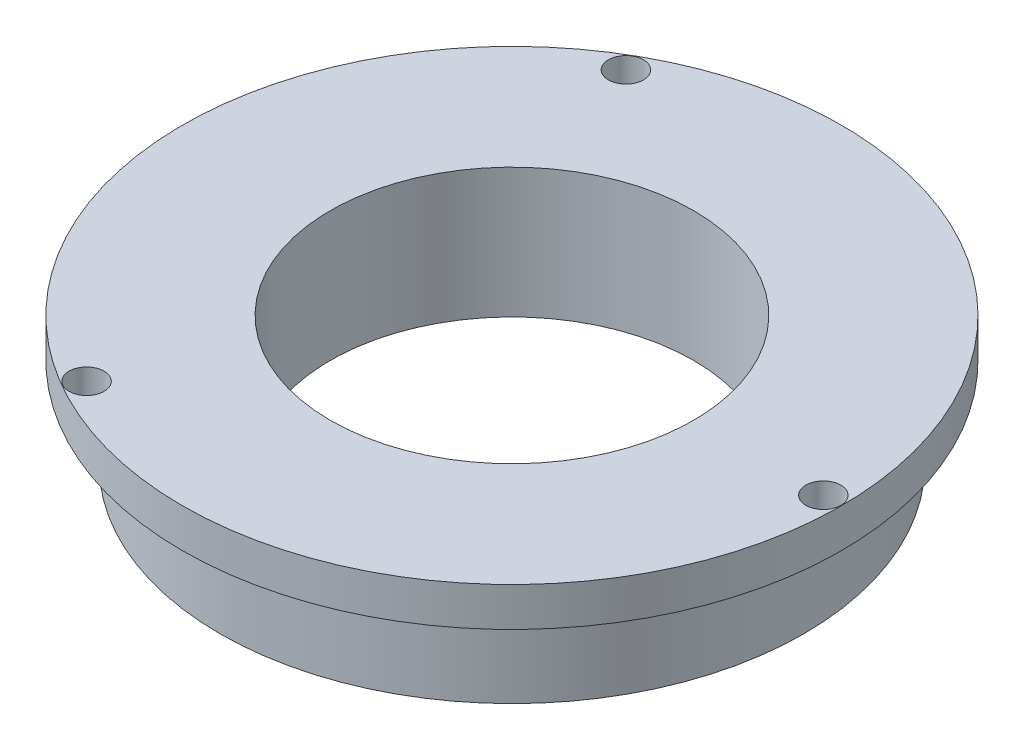
ISO-10303-21;
HEADER;
FILE_DESCRIPTION(('STEP AP214'),'2;1');
FILE_NAME('part.step','',(''),(''),'','','');
FILE_SCHEMA(('AUTOMOTIVE_DESIGN { 1 0 10303 214 1 1 1 1 }'));
ENDSEC;
DATA;
#1=APPLICATION_CONTEXT('core data for automotive mechanical design processes');
#2=APPLICATION_PROTOCOL_DEFINITION('international standard','automotive_design',2000,#1);
#3=PRODUCT_CONTEXT('',#1,'mechanical');
#4=PRODUCT('Part','Part','',(#3));
#5=PRODUCT_RELATED_PRODUCT_CATEGORY('part','',(#4));
#6=PRODUCT_DEFINITION_FORMATION('','',#4);
#7=PRODUCT_DEFINITION_CONTEXT('part definition',#1,'design');
#8=PRODUCT_DEFINITION('design','',#6,#7);
#9=PRODUCT_DEFINITION_SHAPE('','',#8);
#10=(LENGTH_UNIT() NAMED_UNIT(*) SI_UNIT(.MILLI.,.METRE.));
#11=(NAMED_UNIT(*) PLANE_ANGLE_UNIT() SI_UNIT($,.RADIAN.));
#12=(NAMED_UNIT(*) SI_UNIT($,.STERADIAN.) SOLID_ANGLE_UNIT());
#13=UNCERTAINTY_MEASURE_WITH_UNIT(LENGTH_MEASURE(1.E-05),#10,'distance_accuracy_value','');
#14=(GEOMETRIC_REPRESENTATION_CONTEXT(3) GLOBAL_UNCERTAINTY_ASSIGNED_CONTEXT((#13)) GLOBAL_UNIT_ASSIGNED_CONTEXT((#10,
#11,#12)) REPRESENTATION_CONTEXT('',''));
#15=CARTESIAN_POINT('',(0.,0.,0.));
#16=DIRECTION('',(0.,0.,1.));
#17=DIRECTION('',(1.,0.,0.));
#18=AXIS2_PLACEMENT_3D('',#15,#16,#17);
#19=CARTESIAN_POINT('',(0.,10.,0.));
#20=DIRECTION('',(0.,1.,0.));
#21=DIRECTION('',(0.,0.,1.));
#22=AXIS2_PLACEMENT_3D('',#19,#20,#21);
#23=PLANE('',#22);
#24=CARTESIAN_POINT('',(-12.0000000000001,10.,20.7846096908265));
#25=DIRECTION('',(0.,1.,0.));
#26=DIRECTION('',(0.,0.,1.));
#27=AXIS2_PLACEMENT_3D('',#24,#25,#26);
#28=CIRCLE('',#27,1.35);
#29=CARTESIAN_POINT('',(-12.0000000000001,10.,22.1346096908265));
#30=VERTEX_POINT('',#29);
#31=EDGE_CURVE('E51',#30,#30,#28,.F.);
#32=ORIENTED_EDGE('',*,*,#31,.T.);
#33=EDGE_LOOP('',(#32));
#34=FACE_BOUND('',#33,.T.);
#35=CARTESIAN_POINT('',(0.,10.,0.));
#36=DIRECTION('',(0.,1.,0.));
#37=DIRECTION('',(0.,0.,1.));
#38=AXIS2_PLACEMENT_3D('',#35,#36,#37);
#39=CIRCLE('',#38,14.);
#40=CARTESIAN_POINT('',(0.,10.,14.));
#41=VERTEX_POINT('',#40);
#42=EDGE_CURVE('E39',#41,#41,#39,.F.);
#43=ORIENTED_EDGE('',*,*,#42,.T.);
#44=EDGE_LOOP('',(#43));
#45=FACE_BOUND('',#44,.T.);
#46=CARTESIAN_POINT('',(0.,10.,0.));
#47=DIRECTION('',(0.,1.,0.));
#48=DIRECTION('',(0.,0.,1.));
#49=AXIS2_PLACEMENT_3D('',#46,#47,#48);
#50=CIRCLE('',#49,25.4);
#51=CARTESIAN_POINT('',(0.,10.,25.4));
#52=VERTEX_POINT('',#51);
#53=EDGE_CURVE('E10',#52,#52,#50,.T.);
#54=ORIENTED_EDGE('',*,*,#53,.T.);
#55=EDGE_LOOP('',(#54));
#56=FACE_BOUND('',#55,.T.);
#57=CARTESIAN_POINT('',(24.,10.,0.));
#58=DIRECTION('',(0.,1.,0.));
#59=DIRECTION('',(0.,0.,1.));
#60=AXIS2_PLACEMENT_3D('',#57,#58,#59);
#61=CIRCLE('',#60,1.35);
#62=CARTESIAN_POINT('',(24.,10.,1.35));
#63=VERTEX_POINT('',#62);
#64=EDGE_CURVE('E50',#63,#63,#61,.F.);
#65=ORIENTED_EDGE('',*,*,#64,.T.);
#66=EDGE_LOOP('',(#65));
#67=FACE_BOUND('',#66,.T.);
#68=CARTESIAN_POINT('',(-11.9999999999998,10.,-20.7846096908266));
#69=DIRECTION('',(0.,1.,0.));
#70=DIRECTION('',(0.,0.,1.));
#71=AXIS2_PLACEMENT_3D('',#68,#69,#70);
#72=CIRCLE('',#71,1.35);
#73=CARTESIAN_POINT('',(-11.9999999999998,10.,-19.4346096908266));
#74=VERTEX_POINT('',#73);
#75=EDGE_CURVE('E54',#74,#74,#72,.F.);
#76=ORIENTED_EDGE('',*,*,#75,.T.);
#77=EDGE_LOOP('',(#76));
#78=FACE_BOUND('',#77,.T.);
#79=ADVANCED_FACE('F31',(#34,#45,#56,#67,#78),#23,.T.);
#80=CARTESIAN_POINT('',(0.,7.,0.));
#81=DIRECTION('',(0.,1.,0.));
#82=DIRECTION('',(0.,0.,1.));
#83=AXIS2_PLACEMENT_3D('',#80,#81,#82);
#84=PLANE('',#83);
#85=CARTESIAN_POINT('',(-12.0000000000001,7.,20.7846096908265));
#86=DIRECTION('',(0.,1.,0.));
#87=DIRECTION('',(0.,0.,1.));
#88=AXIS2_PLACEMENT_3D('',#85,#86,#87);
#89=CIRCLE('',#88,1.35);
#90=CARTESIAN_POINT('',(-12.0000000000001,7.,22.1346096908265));
#91=VERTEX_POINT('',#90);
#92=EDGE_CURVE('E52',#91,#91,#89,.F.);
#93=ORIENTED_EDGE('',*,*,#92,.F.);
#94=EDGE_LOOP('',(#93));
#95=FACE_BOUND('',#94,.T.);
#96=CARTESIAN_POINT('',(0.,7.,0.));
#97=DIRECTION('',(0.,1.,0.));
#98=DIRECTION('',(0.,0.,1.));
#99=AXIS2_PLACEMENT_3D('',#96,#97,#98);
#100=CIRCLE('',#99,22.5);
#101=CARTESIAN_POINT('',(0.,7.,22.5));
#102=VERTEX_POINT('',#101);
#103=EDGE_CURVE('E68',#102,#102,#100,.T.);
#104=ORIENTED_EDGE('',*,*,#103,.T.);
#105=EDGE_LOOP('',(#104));
#106=FACE_BOUND('',#105,.T.);
#107=CARTESIAN_POINT('',(0.,7.,0.));
#108=DIRECTION('',(0.,1.,0.));
#109=DIRECTION('',(0.,0.,1.));
#110=AXIS2_PLACEMENT_3D('',#107,#108,#109);
#111=CIRCLE('',#110,25.4);
#112=CARTESIAN_POINT('',(0.,7.,25.4));
#113=VERTEX_POINT('',#112);
#114=EDGE_CURVE('E71',#113,#113,#111,.T.);
#115=ORIENTED_EDGE('',*,*,#114,.F.);
#116=EDGE_LOOP('',(#115));
#117=FACE_BOUND('',#116,.T.);
#118=CARTESIAN_POINT('',(24.,7.,0.));
#119=DIRECTION('',(0.,1.,0.));
#120=DIRECTION('',(0.,0.,1.));
#121=AXIS2_PLACEMENT_3D('',#118,#119,#120);
#122=CIRCLE('',#121,1.35);
#123=CARTESIAN_POINT('',(24.,7.,1.35));
#124=VERTEX_POINT('',#123);
#125=EDGE_CURVE('E48',#124,#124,#122,.F.);
#126=ORIENTED_EDGE('',*,*,#125,.F.);
#127=EDGE_LOOP('',(#126));
#128=FACE_BOUND('',#127,.T.);
#129=CARTESIAN_POINT('',(-11.9999999999998,7.,-20.7846096908266));
#130=DIRECTION('',(0.,1.,0.));
#131=DIRECTION('',(0.,0.,1.));
#132=AXIS2_PLACEMENT_3D('',#129,#130,#131);
#133=CIRCLE('',#132,1.35);
#134=CARTESIAN_POINT('',(-11.9999999999998,7.,-19.4346096908266));
#135=VERTEX_POINT('',#134);
#136=EDGE_CURVE('E35',#135,#135,#133,.F.);
#137=ORIENTED_EDGE('',*,*,#136,.F.);
#138=EDGE_LOOP('',(#137));
#139=FACE_BOUND('',#138,.T.);
#140=ADVANCED_FACE('F97',(#95,#106,#117,#128,#139),#84,.F.);
#141=CARTESIAN_POINT('',(0.,0.,0.));
#142=DIRECTION('',(0.,1.,0.));
#143=DIRECTION('',(0.,0.,1.));
#144=AXIS2_PLACEMENT_3D('',#141,#142,#143);
#145=PLANE('',#144);
#146=CARTESIAN_POINT('',(0.,0.,0.));
#147=DIRECTION('',(0.,1.,0.));
#148=DIRECTION('',(0.,0.,1.));
#149=AXIS2_PLACEMENT_3D('',#146,#147,#148);
#150=CIRCLE('',#149,22.5);
#151=CARTESIAN_POINT('',(0.,0.,22.5));
#152=VERTEX_POINT('',#151);
#153=EDGE_CURVE('E67',#152,#152,#150,.T.);
#154=ORIENTED_EDGE('',*,*,#153,.F.);
#155=EDGE_LOOP('',(#154));
#156=FACE_BOUND('',#155,.T.);
#157=CARTESIAN_POINT('',(0.,0.,0.));
#158=DIRECTION('',(0.,1.,0.));
#159=DIRECTION('',(0.,0.,1.));
#160=AXIS2_PLACEMENT_3D('',#157,#158,#159);
#161=CIRCLE('',#160,14.);
#162=CARTESIAN_POINT('',(0.,0.,14.));
#163=VERTEX_POINT('',#162);
#164=EDGE_CURVE('E44',#163,#163,#161,.T.);
#165=ORIENTED_EDGE('',*,*,#164,.T.);
#166=EDGE_LOOP('',(#165));
#167=FACE_BOUND('',#166,.T.);
#168=ADVANCED_FACE('F78',(#156,#167),#145,.F.);
#169=CARTESIAN_POINT('',(0.,10.,0.));
#170=DIRECTION('',(0.,-1.,0.));
#171=DIRECTION('',(0.,0.,-1.));
#172=AXIS2_PLACEMENT_3D('',#169,#170,#171);
#173=CYLINDRICAL_SURFACE('',#172,25.4);
#174=ORIENTED_EDGE('',*,*,#114,.T.);
#175=EDGE_LOOP('',(#174));
#176=FACE_BOUND('',#175,.T.);
#177=ORIENTED_EDGE('',*,*,#53,.F.);
#178=EDGE_LOOP('',(#177));
#179=FACE_BOUND('',#178,.T.);
#180=ADVANCED_FACE('F33',(#176,#179),#173,.T.);
#181=CARTESIAN_POINT('',(0.,47.,0.));
#182=DIRECTION('',(0.,-1.,0.));
#183=DIRECTION('',(0.,0.,-1.));
#184=AXIS2_PLACEMENT_3D('',#181,#182,#183);
#185=CYLINDRICAL_SURFACE('',#184,14.);
#186=ORIENTED_EDGE('',*,*,#42,.F.);
#187=EDGE_LOOP('',(#186));
#188=FACE_BOUND('',#187,.T.);
#189=ORIENTED_EDGE('',*,*,#164,.F.);
#190=EDGE_LOOP('',(#189));
#191=FACE_BOUND('',#190,.T.);
#192=ADVANCED_FACE('F80',(#188,#191),#185,.F.);
#193=CARTESIAN_POINT('',(0.,7.,0.));
#194=DIRECTION('',(0.,-1.,0.));
#195=DIRECTION('',(0.,0.,-1.));
#196=AXIS2_PLACEMENT_3D('',#193,#194,#195);
#197=CYLINDRICAL_SURFACE('',#196,22.5);
#198=ORIENTED_EDGE('',*,*,#103,.F.);
#199=EDGE_LOOP('',(#198));
#200=FACE_BOUND('',#199,.T.);
#201=ORIENTED_EDGE('',*,*,#153,.T.);
#202=EDGE_LOOP('',(#201));
#203=FACE_BOUND('',#202,.T.);
#204=ADVANCED_FACE('F82',(#200,#203),#197,.T.);
#205=CARTESIAN_POINT('',(24.,37.,0.));
#206=DIRECTION('',(0.,-1.,0.));
#207=DIRECTION('',(0.,0.,-1.));
#208=AXIS2_PLACEMENT_3D('',#205,#206,#207);
#209=CYLINDRICAL_SURFACE('',#208,1.35);
#210=ORIENTED_EDGE('',*,*,#64,.F.);
#211=EDGE_LOOP('',(#210));
#212=FACE_BOUND('',#211,.T.);
#213=ORIENTED_EDGE('',*,*,#125,.T.);
#214=EDGE_LOOP('',(#213));
#215=FACE_BOUND('',#214,.T.);
#216=ADVANCED_FACE('F89',(#212,#215),#209,.F.);
#217=CARTESIAN_POINT('',(-12.0000000000001,37.,20.7846096908265));
#218=DIRECTION('',(0.,-1.,0.));
#219=DIRECTION('',(0.,0.,-1.));
#220=AXIS2_PLACEMENT_3D('',#217,#218,#219);
#221=CYLINDRICAL_SURFACE('',#220,1.35);
#222=ORIENTED_EDGE('',*,*,#31,.F.);
#223=EDGE_LOOP('',(#222));
#224=FACE_BOUND('',#223,.T.);
#225=ORIENTED_EDGE('',*,*,#92,.T.);
#226=EDGE_LOOP('',(#225));
#227=FACE_BOUND('',#226,.T.);
#228=ADVANCED_FACE('F140',(#224,#227),#221,.F.);
#229=CARTESIAN_POINT('',(-11.9999999999998,37.,-20.7846096908266));
#230=DIRECTION('',(0.,-1.,0.));
#231=DIRECTION('',(0.,0.,-1.));
#232=AXIS2_PLACEMENT_3D('',#229,#230,#231);
#233=CYLINDRICAL_SURFACE('',#232,1.35);
#234=ORIENTED_EDGE('',*,*,#75,.F.);
#235=EDGE_LOOP('',(#234));
#236=FACE_BOUND('',#235,.T.);
#237=ORIENTED_EDGE('',*,*,#136,.T.);
#238=EDGE_LOOP('',(#237));
#239=FACE_BOUND('',#238,.T.);
#240=ADVANCED_FACE('F150',(#236,#239),#233,.F.);
#241=CLOSED_SHELL('',(#79,#140,#168,#180,#192,#204,#216,#228,#240));
#242=MANIFOLD_SOLID_BREP('B2',#241);
#243=ADVANCED_BREP_SHAPE_REPRESENTATION('',(#18,#242),#14);
#244=SHAPE_DEFINITION_REPRESENTATION(#9,#243);
ENDSEC;
END-ISO-10303-21;
